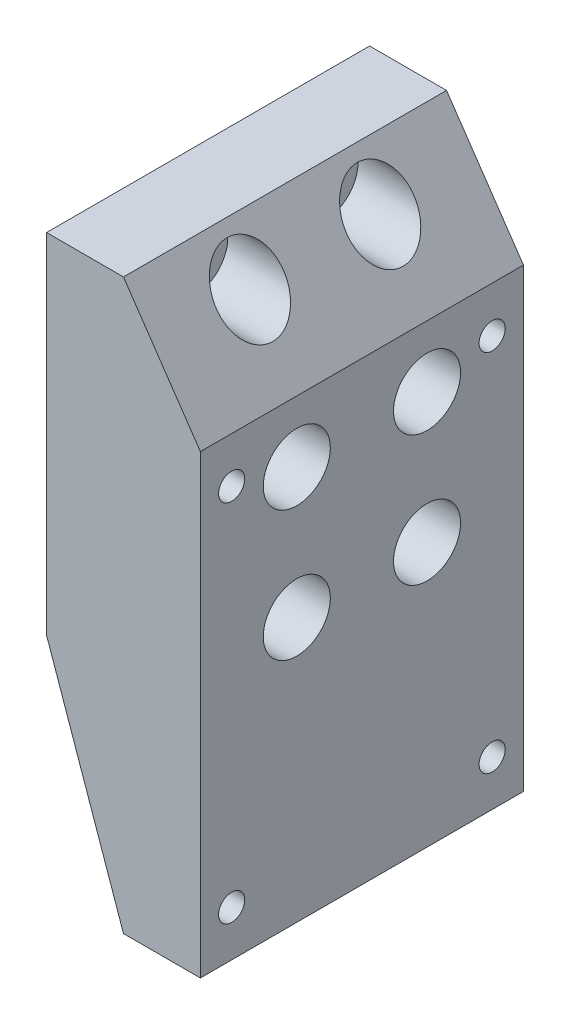
ISO-10303-21;
HEADER;
FILE_DESCRIPTION(('STEP AP214'),'2;1');
FILE_NAME('part.step','',(''),(''),'','','');
FILE_SCHEMA(('AUTOMOTIVE_DESIGN { 1 0 10303 214 1 1 1 1 }'));
ENDSEC;
DATA;
#1=APPLICATION_CONTEXT('core data for automotive mechanical design processes');
#2=APPLICATION_PROTOCOL_DEFINITION('international standard','automotive_design',2000,#1);
#3=PRODUCT_CONTEXT('',#1,'mechanical');
#4=PRODUCT('Part','Part','',(#3));
#5=PRODUCT_RELATED_PRODUCT_CATEGORY('part','',(#4));
#6=PRODUCT_DEFINITION_FORMATION('','',#4);
#7=PRODUCT_DEFINITION_CONTEXT('part definition',#1,'design');
#8=PRODUCT_DEFINITION('design','',#6,#7);
#9=PRODUCT_DEFINITION_SHAPE('','',#8);
#10=(LENGTH_UNIT() NAMED_UNIT(*) SI_UNIT(.MILLI.,.METRE.));
#11=(NAMED_UNIT(*) PLANE_ANGLE_UNIT() SI_UNIT($,.RADIAN.));
#12=(NAMED_UNIT(*) SI_UNIT($,.STERADIAN.) SOLID_ANGLE_UNIT());
#13=UNCERTAINTY_MEASURE_WITH_UNIT(LENGTH_MEASURE(1.E-05),#10,'distance_accuracy_value','');
#14=(GEOMETRIC_REPRESENTATION_CONTEXT(3) GLOBAL_UNCERTAINTY_ASSIGNED_CONTEXT((#13)) GLOBAL_UNIT_ASSIGNED_CONTEXT((#10,
#11,#12)) REPRESENTATION_CONTEXT('',''));
#15=CARTESIAN_POINT('',(0.,0.,0.));
#16=DIRECTION('',(0.,0.,1.));
#17=DIRECTION('',(1.,0.,0.));
#18=AXIS2_PLACEMENT_3D('',#15,#16,#17);
#19=CARTESIAN_POINT('',(24.277424259904,36.7962343326719,18.8));
#20=DIRECTION('',(-1.,0.,0.));
#21=DIRECTION('',(0.,0.,1.));
#22=AXIS2_PLACEMENT_3D('',#19,#20,#21);
#23=CYLINDRICAL_SURFACE('',#22,3.5687);
#24=CARTESIAN_POINT('',(-38.722575740096,36.7962343326719,18.8));
#25=DIRECTION('',(-1.,0.,0.));
#26=DIRECTION('',(0.,0.,1.));
#27=AXIS2_PLACEMENT_3D('',#24,#25,#26);
#28=CIRCLE('',#27,3.5687);
#29=CARTESIAN_POINT('',(-38.722575740096,36.7962343326719,22.3687));
#30=VERTEX_POINT('',#29);
#31=EDGE_CURVE('E133',#30,#30,#28,.T.);
#32=ORIENTED_EDGE('',*,*,#31,.T.);
#33=EDGE_LOOP('',(#32));
#34=FACE_BOUND('',#33,.T.);
#35=CARTESIAN_POINT('',(-28.722575740096,36.7962343326719,18.8));
#36=DIRECTION('',(1.,0.,0.));
#37=DIRECTION('',(0.,1.,0.));
#38=AXIS2_PLACEMENT_3D('',#35,#36,#37);
#39=CIRCLE('',#38,3.5687);
#40=CARTESIAN_POINT('',(-28.722575740096,40.3649343326719,18.8));
#41=VERTEX_POINT('',#40);
#42=EDGE_CURVE('E162',#41,#41,#39,.F.);
#43=ORIENTED_EDGE('',*,*,#42,.F.);
#44=EDGE_LOOP('',(#43));
#45=FACE_BOUND('',#44,.T.);
#46=ADVANCED_FACE('F39',(#34,#45),#23,.F.);
#47=CARTESIAN_POINT('',(24.277424259904,36.7962343326719,44.2));
#48=DIRECTION('',(-1.,0.,0.));
#49=DIRECTION('',(0.,0.,1.));
#50=AXIS2_PLACEMENT_3D('',#47,#48,#49);
#51=CYLINDRICAL_SURFACE('',#50,3.5687);
#52=CARTESIAN_POINT('',(-38.722575740096,36.7962343326719,44.2));
#53=DIRECTION('',(-1.,0.,0.));
#54=DIRECTION('',(0.,0.,1.));
#55=AXIS2_PLACEMENT_3D('',#52,#53,#54);
#56=CIRCLE('',#55,3.5687);
#57=CARTESIAN_POINT('',(-38.722575740096,36.7962343326719,47.7687));
#58=VERTEX_POINT('',#57);
#59=EDGE_CURVE('E187',#58,#58,#56,.T.);
#60=ORIENTED_EDGE('',*,*,#59,.T.);
#61=EDGE_LOOP('',(#60));
#62=FACE_BOUND('',#61,.T.);
#63=CARTESIAN_POINT('',(-28.722575740096,36.7962343326719,44.2));
#64=DIRECTION('',(1.,0.,0.));
#65=DIRECTION('',(0.,1.,0.));
#66=AXIS2_PLACEMENT_3D('',#63,#64,#65);
#67=CIRCLE('',#66,3.5687);
#68=CARTESIAN_POINT('',(-28.722575740096,40.3649343326719,44.2));
#69=VERTEX_POINT('',#68);
#70=EDGE_CURVE('E159',#69,#69,#67,.F.);
#71=ORIENTED_EDGE('',*,*,#70,.F.);
#72=EDGE_LOOP('',(#71));
#73=FACE_BOUND('',#72,.T.);
#74=ADVANCED_FACE('F217',(#62,#73),#51,.F.);
#75=CARTESIAN_POINT('',(24.277424259904,-14.0037656673281,44.2));
#76=DIRECTION('',(-1.,0.,0.));
#77=DIRECTION('',(0.,0.,1.));
#78=AXIS2_PLACEMENT_3D('',#75,#76,#77);
#79=CYLINDRICAL_SURFACE('',#78,3.5687);
#80=CARTESIAN_POINT('',(-38.722575740096,-14.0037656673281,44.2));
#81=DIRECTION('',(-1.,0.,0.));
#82=DIRECTION('',(0.,0.,1.));
#83=AXIS2_PLACEMENT_3D('',#80,#81,#82);
#84=CIRCLE('',#83,3.5687);
#85=CARTESIAN_POINT('',(-38.722575740096,-14.0037656673281,47.7687));
#86=VERTEX_POINT('',#85);
#87=EDGE_CURVE('E169',#86,#86,#84,.T.);
#88=ORIENTED_EDGE('',*,*,#87,.T.);
#89=EDGE_LOOP('',(#88));
#90=FACE_BOUND('',#89,.T.);
#91=CARTESIAN_POINT('',(-28.722575740096,-14.0037656673281,44.2));
#92=DIRECTION('',(1.,0.,0.));
#93=DIRECTION('',(0.,1.,0.));
#94=AXIS2_PLACEMENT_3D('',#91,#92,#93);
#95=CIRCLE('',#94,3.5687);
#96=CARTESIAN_POINT('',(-28.722575740096,-10.4350656673281,44.2));
#97=VERTEX_POINT('',#96);
#98=EDGE_CURVE('E156',#97,#97,#95,.F.);
#99=ORIENTED_EDGE('',*,*,#98,.F.);
#100=EDGE_LOOP('',(#99));
#101=FACE_BOUND('',#100,.T.);
#102=ADVANCED_FACE('F223',(#90,#101),#79,.F.);
#103=CARTESIAN_POINT('',(24.277424259904,11.3962343326719,18.8));
#104=DIRECTION('',(-1.,0.,0.));
#105=DIRECTION('',(0.,0.,1.));
#106=AXIS2_PLACEMENT_3D('',#103,#104,#105);
#107=CYLINDRICAL_SURFACE('',#106,3.5687);
#108=CARTESIAN_POINT('',(-38.722575740096,11.3962343326719,18.8));
#109=DIRECTION('',(-1.,0.,0.));
#110=DIRECTION('',(0.,0.,1.));
#111=AXIS2_PLACEMENT_3D('',#108,#109,#110);
#112=CIRCLE('',#111,3.5687);
#113=CARTESIAN_POINT('',(-38.722575740096,11.3962343326719,22.3687));
#114=VERTEX_POINT('',#113);
#115=EDGE_CURVE('E185',#114,#114,#112,.T.);
#116=ORIENTED_EDGE('',*,*,#115,.T.);
#117=EDGE_LOOP('',(#116));
#118=FACE_BOUND('',#117,.T.);
#119=CARTESIAN_POINT('',(-28.722575740096,11.3962343326719,18.8));
#120=DIRECTION('',(1.,0.,0.));
#121=DIRECTION('',(0.,1.,0.));
#122=AXIS2_PLACEMENT_3D('',#119,#120,#121);
#123=CIRCLE('',#122,3.5687);
#124=CARTESIAN_POINT('',(-28.722575740096,14.9649343326719,18.8));
#125=VERTEX_POINT('',#124);
#126=EDGE_CURVE('E153',#125,#125,#123,.F.);
#127=ORIENTED_EDGE('',*,*,#126,.F.);
#128=EDGE_LOOP('',(#127));
#129=FACE_BOUND('',#128,.T.);
#130=ADVANCED_FACE('F228',(#118,#129),#107,.F.);
#131=CARTESIAN_POINT('',(24.277424259904,11.3962343326719,44.2));
#132=DIRECTION('',(-1.,0.,0.));
#133=DIRECTION('',(0.,0.,1.));
#134=AXIS2_PLACEMENT_3D('',#131,#132,#133);
#135=CYLINDRICAL_SURFACE('',#134,3.5687);
#136=CARTESIAN_POINT('',(-38.722575740096,11.3962343326719,44.2));
#137=DIRECTION('',(-1.,0.,0.));
#138=DIRECTION('',(0.,0.,1.));
#139=AXIS2_PLACEMENT_3D('',#136,#137,#138);
#140=CIRCLE('',#139,3.5687);
#141=CARTESIAN_POINT('',(-38.722575740096,11.3962343326719,47.7687));
#142=VERTEX_POINT('',#141);
#143=EDGE_CURVE('E178',#142,#142,#140,.T.);
#144=ORIENTED_EDGE('',*,*,#143,.T.);
#145=EDGE_LOOP('',(#144));
#146=FACE_BOUND('',#145,.T.);
#147=CARTESIAN_POINT('',(-28.722575740096,11.3962343326719,44.2));
#148=DIRECTION('',(1.,0.,0.));
#149=DIRECTION('',(0.,1.,0.));
#150=AXIS2_PLACEMENT_3D('',#147,#148,#149);
#151=CIRCLE('',#150,3.5687);
#152=CARTESIAN_POINT('',(-28.722575740096,14.9649343326719,44.2));
#153=VERTEX_POINT('',#152);
#154=EDGE_CURVE('E149',#153,#153,#151,.F.);
#155=ORIENTED_EDGE('',*,*,#154,.F.);
#156=EDGE_LOOP('',(#155));
#157=FACE_BOUND('',#156,.T.);
#158=ADVANCED_FACE('F282',(#146,#157),#135,.F.);
#159=CARTESIAN_POINT('',(24.277424259904,-14.0037656673281,18.8));
#160=DIRECTION('',(-1.,0.,0.));
#161=DIRECTION('',(0.,0.,1.));
#162=AXIS2_PLACEMENT_3D('',#159,#160,#161);
#163=CYLINDRICAL_SURFACE('',#162,3.5687);
#164=CARTESIAN_POINT('',(-38.722575740096,-14.0037656673281,18.8));
#165=DIRECTION('',(-1.,0.,0.));
#166=DIRECTION('',(0.,0.,1.));
#167=AXIS2_PLACEMENT_3D('',#164,#165,#166);
#168=CIRCLE('',#167,3.5687);
#169=CARTESIAN_POINT('',(-38.722575740096,-14.0037656673281,22.3687));
#170=VERTEX_POINT('',#169);
#171=EDGE_CURVE('E173',#170,#170,#168,.T.);
#172=ORIENTED_EDGE('',*,*,#171,.T.);
#173=EDGE_LOOP('',(#172));
#174=FACE_BOUND('',#173,.T.);
#175=CARTESIAN_POINT('',(-28.722575740096,-14.0037656673281,18.8));
#176=DIRECTION('',(1.,0.,0.));
#177=DIRECTION('',(0.,1.,0.));
#178=AXIS2_PLACEMENT_3D('',#175,#176,#177);
#179=CIRCLE('',#178,3.5687);
#180=CARTESIAN_POINT('',(-28.722575740096,-10.4350656673281,18.8));
#181=VERTEX_POINT('',#180);
#182=EDGE_CURVE('E146',#181,#181,#179,.F.);
#183=ORIENTED_EDGE('',*,*,#182,.F.);
#184=EDGE_LOOP('',(#183));
#185=FACE_BOUND('',#184,.T.);
#186=ADVANCED_FACE('F285',(#174,#185),#163,.F.);
#187=CARTESIAN_POINT('',(-23.722575740096,45.3962343326719,63.));
#188=DIRECTION('',(0.,-1.,0.));
#189=DIRECTION('',(0.,0.,-1.));
#190=AXIS2_PLACEMENT_3D('',#187,#188,#189);
#191=PLANE('',#190);
#192=DIRECTION('',(-1.,0.,0.));
#193=VECTOR('',#192,1.);
#194=CARTESIAN_POINT('',(-23.722575740096,45.3962343326719,0.));
#195=LINE('',#194,#193);
#196=CARTESIAN_POINT('',(-23.722575740096,45.3962343326719,0.));
#197=VERTEX_POINT('',#196);
#198=CARTESIAN_POINT('',(-38.722575740096,45.3962343326719,0.));
#199=VERTEX_POINT('',#198);
#200=EDGE_CURVE('E129',#197,#199,#195,.T.);
#201=ORIENTED_EDGE('',*,*,#200,.T.);
#202=DIRECTION('',(0.,0.,-1.));
#203=VECTOR('',#202,1.);
#204=CARTESIAN_POINT('',(-38.722575740096,45.3962343326719,63.));
#205=LINE('',#204,#203);
#206=CARTESIAN_POINT('',(-38.722575740096,45.3962343326719,63.));
#207=VERTEX_POINT('',#206);
#208=EDGE_CURVE('E11',#207,#199,#205,.T.);
#209=ORIENTED_EDGE('',*,*,#208,.F.);
#210=DIRECTION('',(-1.,0.,0.));
#211=VECTOR('',#210,1.);
#212=CARTESIAN_POINT('',(-23.722575740096,45.3962343326719,63.));
#213=LINE('',#212,#211);
#214=CARTESIAN_POINT('',(-23.722575740096,45.3962343326719,63.));
#215=VERTEX_POINT('',#214);
#216=EDGE_CURVE('E140',#215,#207,#213,.T.);
#217=ORIENTED_EDGE('',*,*,#216,.F.);
#218=DIRECTION('',(0.,0.,-1.));
#219=VECTOR('',#218,1.);
#220=CARTESIAN_POINT('',(-23.722575740096,45.3962343326719,63.));
#221=LINE('',#220,#219);
#222=EDGE_CURVE('E125',#215,#197,#221,.T.);
#223=ORIENTED_EDGE('',*,*,#222,.T.);
#224=EDGE_LOOP('',(#201,#209,#217,#223));
#225=FACE_BOUND('',#224,.T.);
#226=ADVANCED_FACE('F41',(#225),#191,.F.);
#227=CARTESIAN_POINT('',(-38.722575740096,45.3962343326719,63.));
#228=DIRECTION('',(1.,0.,0.));
#229=DIRECTION('',(0.,1.,0.));
#230=AXIS2_PLACEMENT_3D('',#227,#228,#229);
#231=PLANE('',#230);
#232=ORIENTED_EDGE('',*,*,#171,.F.);
#233=EDGE_LOOP('',(#232));
#234=FACE_BOUND('',#233,.T.);
#235=ORIENTED_EDGE('',*,*,#143,.F.);
#236=EDGE_LOOP('',(#235));
#237=FACE_BOUND('',#236,.T.);
#238=ORIENTED_EDGE('',*,*,#115,.F.);
#239=EDGE_LOOP('',(#238));
#240=FACE_BOUND('',#239,.T.);
#241=ORIENTED_EDGE('',*,*,#59,.F.);
#242=EDGE_LOOP('',(#241));
#243=FACE_BOUND('',#242,.T.);
#244=ORIENTED_EDGE('',*,*,#87,.F.);
#245=EDGE_LOOP('',(#244));
#246=FACE_BOUND('',#245,.T.);
#247=ORIENTED_EDGE('',*,*,#31,.F.);
#248=EDGE_LOOP('',(#247));
#249=FACE_BOUND('',#248,.T.);
#250=DIRECTION('',(0.,-1.,0.));
#251=VECTOR('',#250,1.);
#252=CARTESIAN_POINT('',(-38.722575740096,45.3962343326719,0.));
#253=LINE('',#252,#251);
#254=CARTESIAN_POINT('',(-38.722575740096,-22.6037656673281,0.));
#255=VERTEX_POINT('',#254);
#256=EDGE_CURVE('E132',#199,#255,#253,.T.);
#257=ORIENTED_EDGE('',*,*,#256,.T.);
#258=DIRECTION('',(0.,0.,-1.));
#259=VECTOR('',#258,1.);
#260=CARTESIAN_POINT('',(-38.722575740096,-22.6037656673281,63.));
#261=LINE('',#260,#259);
#262=CARTESIAN_POINT('',(-38.722575740096,-22.6037656673281,63.));
#263=VERTEX_POINT('',#262);
#264=EDGE_CURVE('E49',#263,#255,#261,.T.);
#265=ORIENTED_EDGE('',*,*,#264,.F.);
#266=DIRECTION('',(0.,-1.,0.));
#267=VECTOR('',#266,1.);
#268=CARTESIAN_POINT('',(-38.722575740096,45.3962343326719,63.));
#269=LINE('',#268,#267);
#270=EDGE_CURVE('E96',#207,#263,#269,.T.);
#271=ORIENTED_EDGE('',*,*,#270,.F.);
#272=ORIENTED_EDGE('',*,*,#208,.T.);
#273=EDGE_LOOP('',(#257,#265,#271,#272));
#274=FACE_BOUND('',#273,.T.);
#275=ADVANCED_FACE('F197',(#234,#237,#240,#243,#246,#249,#274),#231,.F.);
#276=CARTESIAN_POINT('',(-38.722575740096,-22.6037656673281,63.));
#277=DIRECTION('',(0.943961223465791,0.330056371841186,0.));
#278=DIRECTION('',(-0.330056371841186,0.943961223465791,0.));
#279=AXIS2_PLACEMENT_3D('',#276,#277,#278);
#280=PLANE('',#279);
#281=DIRECTION('',(0.330056371841186,-0.943961223465791,0.));
#282=VECTOR('',#281,1.);
#283=CARTESIAN_POINT('',(-38.722575740096,-22.6037656673281,0.));
#284=LINE('',#283,#282);
#285=CARTESIAN_POINT('',(-23.722575740096,-65.5037656673281,0.));
#286=VERTEX_POINT('',#285);
#287=EDGE_CURVE('E135',#255,#286,#284,.T.);
#288=ORIENTED_EDGE('',*,*,#287,.T.);
#289=DIRECTION('',(0.,0.,-1.));
#290=VECTOR('',#289,1.);
#291=CARTESIAN_POINT('',(-23.722575740096,-65.5037656673281,63.));
#292=LINE('',#291,#290);
#293=CARTESIAN_POINT('',(-23.722575740096,-65.5037656673281,63.));
#294=VERTEX_POINT('',#293);
#295=EDGE_CURVE('E120',#294,#286,#292,.T.);
#296=ORIENTED_EDGE('',*,*,#295,.F.);
#297=DIRECTION('',(0.330056371841186,-0.943961223465791,0.));
#298=VECTOR('',#297,1.);
#299=CARTESIAN_POINT('',(-38.722575740096,-22.6037656673281,63.));
#300=LINE('',#299,#298);
#301=EDGE_CURVE('E111',#263,#294,#300,.T.);
#302=ORIENTED_EDGE('',*,*,#301,.F.);
#303=ORIENTED_EDGE('',*,*,#264,.T.);
#304=EDGE_LOOP('',(#288,#296,#302,#303));
#305=FACE_BOUND('',#304,.T.);
#306=ADVANCED_FACE('F200',(#305),#280,.F.);
#307=CARTESIAN_POINT('',(-23.722575740096,-65.5037656673281,63.));
#308=DIRECTION('',(0.,1.,0.));
#309=DIRECTION('',(0.,0.,1.));
#310=AXIS2_PLACEMENT_3D('',#307,#308,#309);
#311=PLANE('',#310);
#312=DIRECTION('',(1.,0.,0.));
#313=VECTOR('',#312,1.);
#314=CARTESIAN_POINT('',(-23.722575740096,-65.5037656673281,0.));
#315=LINE('',#314,#313);
#316=CARTESIAN_POINT('',(-8.72257574009599,-65.5037656673281,0.));
#317=VERTEX_POINT('',#316);
#318=EDGE_CURVE('E119',#286,#317,#315,.T.);
#319=ORIENTED_EDGE('',*,*,#318,.T.);
#320=DIRECTION('',(0.,0.,-1.));
#321=VECTOR('',#320,1.);
#322=CARTESIAN_POINT('',(-8.72257574009599,-65.5037656673281,63.));
#323=LINE('',#322,#321);
#324=CARTESIAN_POINT('',(-8.72257574009599,-65.5037656673281,63.));
#325=VERTEX_POINT('',#324);
#326=EDGE_CURVE('E116',#325,#317,#323,.T.);
#327=ORIENTED_EDGE('',*,*,#326,.F.);
#328=DIRECTION('',(1.,0.,0.));
#329=VECTOR('',#328,1.);
#330=CARTESIAN_POINT('',(-23.722575740096,-65.5037656673281,63.));
#331=LINE('',#330,#329);
#332=EDGE_CURVE('E105',#294,#325,#331,.T.);
#333=ORIENTED_EDGE('',*,*,#332,.F.);
#334=ORIENTED_EDGE('',*,*,#295,.T.);
#335=EDGE_LOOP('',(#319,#327,#333,#334));
#336=FACE_BOUND('',#335,.T.);
#337=ADVANCED_FACE('F117',(#336),#311,.F.);
#338=CARTESIAN_POINT('',(-8.72257574009599,-65.5037656673281,63.));
#339=DIRECTION('',(-1.,0.,0.));
#340=DIRECTION('',(0.,0.,1.));
#341=AXIS2_PLACEMENT_3D('',#338,#339,#340);
#342=PLANE('',#341);
#343=CARTESIAN_POINT('',(-8.72257574009599,14.5062343326719,56.9));
#344=DIRECTION('',(1.,0.,0.));
#345=DIRECTION('',(0.,0.,-1.));
#346=AXIS2_PLACEMENT_3D('',#343,#344,#345);
#347=CIRCLE('',#346,2.5527);
#348=CARTESIAN_POINT('',(-8.72257574009599,14.5062343326719,54.3473));
#349=VERTEX_POINT('',#348);
#350=EDGE_CURVE('E522',#349,#349,#347,.T.);
#351=ORIENTED_EDGE('',*,*,#350,.F.);
#352=EDGE_LOOP('',(#351));
#353=FACE_BOUND('',#352,.T.);
#354=CARTESIAN_POINT('',(-8.72257574009599,14.5062343326719,6.10000000000001));
#355=DIRECTION('',(1.,0.,0.));
#356=DIRECTION('',(0.,0.,-1.));
#357=AXIS2_PLACEMENT_3D('',#354,#355,#356);
#358=CIRCLE('',#357,2.5527);
#359=CARTESIAN_POINT('',(-8.72257574009599,14.5062343326719,3.54730000000001));
#360=VERTEX_POINT('',#359);
#361=EDGE_CURVE('E524',#360,#360,#358,.T.);
#362=ORIENTED_EDGE('',*,*,#361,.F.);
#363=EDGE_LOOP('',(#362));
#364=FACE_BOUND('',#363,.T.);
#365=CARTESIAN_POINT('',(-8.72257574009599,-56.6137656673281,56.9));
#366=DIRECTION('',(1.,0.,0.));
#367=DIRECTION('',(0.,0.,-1.));
#368=AXIS2_PLACEMENT_3D('',#365,#366,#367);
#369=CIRCLE('',#368,2.5527);
#370=CARTESIAN_POINT('',(-8.72257574009599,-56.6137656673281,54.3473));
#371=VERTEX_POINT('',#370);
#372=EDGE_CURVE('E532',#371,#371,#369,.T.);
#373=ORIENTED_EDGE('',*,*,#372,.F.);
#374=EDGE_LOOP('',(#373));
#375=FACE_BOUND('',#374,.T.);
#376=CARTESIAN_POINT('',(-8.72257574009599,-56.6137656673281,6.10000000000001));
#377=DIRECTION('',(1.,0.,0.));
#378=DIRECTION('',(0.,0.,-1.));
#379=AXIS2_PLACEMENT_3D('',#376,#377,#378);
#380=CIRCLE('',#379,2.5527);
#381=CARTESIAN_POINT('',(-8.72257574009599,-56.6137656673281,3.54730000000002));
#382=VERTEX_POINT('',#381);
#383=EDGE_CURVE('E538',#382,#382,#380,.T.);
#384=ORIENTED_EDGE('',*,*,#383,.F.);
#385=EDGE_LOOP('',(#384));
#386=FACE_BOUND('',#385,.T.);
#387=CARTESIAN_POINT('',(-8.72257574009599,-14.0037656673281,18.8));
#388=DIRECTION('',(1.,0.,0.));
#389=DIRECTION('',(0.,1.,0.));
#390=AXIS2_PLACEMENT_3D('',#387,#388,#389);
#391=CIRCLE('',#390,6.5405);
#392=CARTESIAN_POINT('',(-8.72257574009599,-7.46326566732811,18.8));
#393=VERTEX_POINT('',#392);
#394=EDGE_CURVE('E550',#393,#393,#391,.T.);
#395=ORIENTED_EDGE('',*,*,#394,.F.);
#396=EDGE_LOOP('',(#395));
#397=FACE_BOUND('',#396,.T.);
#398=CARTESIAN_POINT('',(-8.72257574009599,11.3962343326719,18.8));
#399=DIRECTION('',(1.,0.,0.));
#400=DIRECTION('',(0.,1.,0.));
#401=AXIS2_PLACEMENT_3D('',#398,#399,#400);
#402=CIRCLE('',#401,6.5405);
#403=CARTESIAN_POINT('',(-8.72257574009599,17.9367343326719,18.8));
#404=VERTEX_POINT('',#403);
#405=EDGE_CURVE('E556',#404,#404,#402,.T.);
#406=ORIENTED_EDGE('',*,*,#405,.F.);
#407=EDGE_LOOP('',(#406));
#408=FACE_BOUND('',#407,.T.);
#409=CARTESIAN_POINT('',(-8.72257574009599,11.3962343326719,44.2));
#410=DIRECTION('',(1.,0.,0.));
#411=DIRECTION('',(0.,1.,0.));
#412=AXIS2_PLACEMENT_3D('',#409,#410,#411);
#413=CIRCLE('',#412,6.5405);
#414=CARTESIAN_POINT('',(-8.72257574009599,17.9367343326719,44.2));
#415=VERTEX_POINT('',#414);
#416=EDGE_CURVE('E562',#415,#415,#413,.T.);
#417=ORIENTED_EDGE('',*,*,#416,.F.);
#418=EDGE_LOOP('',(#417));
#419=FACE_BOUND('',#418,.T.);
#420=CARTESIAN_POINT('',(-8.72257574009599,-14.0037656673281,44.2));
#421=DIRECTION('',(1.,0.,0.));
#422=DIRECTION('',(0.,1.,0.));
#423=AXIS2_PLACEMENT_3D('',#420,#421,#422);
#424=CIRCLE('',#423,6.5405);
#425=CARTESIAN_POINT('',(-8.72257574009599,-7.46326566732811,44.2));
#426=VERTEX_POINT('',#425);
#427=EDGE_CURVE('E182',#426,#426,#424,.T.);
#428=ORIENTED_EDGE('',*,*,#427,.F.);
#429=EDGE_LOOP('',(#428));
#430=FACE_BOUND('',#429,.T.);
#431=DIRECTION('',(0.,1.,0.));
#432=VECTOR('',#431,1.);
#433=CARTESIAN_POINT('',(-8.72257574009599,-65.5037656673281,0.));
#434=LINE('',#433,#432);
#435=CARTESIAN_POINT('',(-8.72257574009599,23.3962343326719,0.));
#436=VERTEX_POINT('',#435);
#437=EDGE_CURVE('E82',#317,#436,#434,.T.);
#438=ORIENTED_EDGE('',*,*,#437,.T.);
#439=DIRECTION('',(0.,0.,-1.));
#440=VECTOR('',#439,1.);
#441=CARTESIAN_POINT('',(-8.72257574009599,23.3962343326719,63.));
#442=LINE('',#441,#440);
#443=CARTESIAN_POINT('',(-8.72257574009599,23.3962343326719,63.));
#444=VERTEX_POINT('',#443);
#445=EDGE_CURVE('E121',#444,#436,#442,.T.);
#446=ORIENTED_EDGE('',*,*,#445,.F.);
#447=DIRECTION('',(0.,1.,0.));
#448=VECTOR('',#447,1.);
#449=CARTESIAN_POINT('',(-8.72257574009599,-65.5037656673281,63.));
#450=LINE('',#449,#448);
#451=EDGE_CURVE('E109',#325,#444,#450,.T.);
#452=ORIENTED_EDGE('',*,*,#451,.F.);
#453=ORIENTED_EDGE('',*,*,#326,.T.);
#454=EDGE_LOOP('',(#438,#446,#452,#453));
#455=FACE_BOUND('',#454,.T.);
#456=ADVANCED_FACE('F123',(#353,#364,#375,#386,#397,#408,#419,#430,#455),#342,.F.);
#457=CARTESIAN_POINT('',(-8.72257574009599,23.3962343326719,63.));
#458=DIRECTION('',(-0.826227342807547,-0.56333682464151,0.));
#459=DIRECTION('',(0.56333682464151,-0.826227342807547,0.));
#460=AXIS2_PLACEMENT_3D('',#457,#458,#459);
#461=PLANE('',#460);
#462=CARTESIAN_POINT('',(-17.8589393764596,36.7962343326719,44.2));
#463=DIRECTION('',(-0.826227342807547,-0.56333682464151,0.));
#464=DIRECTION('',(0.56333682464151,-0.826227342807547,0.));
#465=AXIS2_PLACEMENT_3D('',#462,#463,#464);
#466=ELLIPSE('',#465,7.91610209579262,6.5405);
#467=CARTESIAN_POINT('',(-13.3995075582778,30.2557343326719,44.2));
#468=VERTEX_POINT('',#467);
#469=EDGE_CURVE('E43',#468,#468,#466,.T.);
#470=ORIENTED_EDGE('',*,*,#469,.T.);
#471=EDGE_LOOP('',(#470));
#472=FACE_BOUND('',#471,.T.);
#473=CARTESIAN_POINT('',(-17.8589393764596,36.7962343326719,18.8));
#474=DIRECTION('',(-0.826227342807547,-0.56333682464151,0.));
#475=DIRECTION('',(0.56333682464151,-0.826227342807547,0.));
#476=AXIS2_PLACEMENT_3D('',#473,#474,#475);
#477=ELLIPSE('',#476,7.91610209579263,6.5405);
#478=CARTESIAN_POINT('',(-13.3995075582778,30.2557343326719,18.8));
#479=VERTEX_POINT('',#478);
#480=EDGE_CURVE('E164',#479,#479,#477,.T.);
#481=ORIENTED_EDGE('',*,*,#480,.T.);
#482=EDGE_LOOP('',(#481));
#483=FACE_BOUND('',#482,.T.);
#484=DIRECTION('',(-0.56333682464151,0.826227342807547,0.));
#485=VECTOR('',#484,1.);
#486=CARTESIAN_POINT('',(-8.72257574009599,23.3962343326719,0.));
#487=LINE('',#486,#485);
#488=EDGE_CURVE('E88',#436,#197,#487,.T.);
#489=ORIENTED_EDGE('',*,*,#488,.T.);
#490=ORIENTED_EDGE('',*,*,#222,.F.);
#491=DIRECTION('',(-0.56333682464151,0.826227342807547,0.));
#492=VECTOR('',#491,1.);
#493=CARTESIAN_POINT('',(-8.72257574009599,23.3962343326719,63.));
#494=LINE('',#493,#492);
#495=EDGE_CURVE('E58',#444,#215,#494,.T.);
#496=ORIENTED_EDGE('',*,*,#495,.F.);
#497=ORIENTED_EDGE('',*,*,#445,.T.);
#498=EDGE_LOOP('',(#489,#490,#496,#497));
#499=FACE_BOUND('',#498,.T.);
#500=ADVANCED_FACE('F205',(#472,#483,#499),#461,.F.);
#501=CARTESIAN_POINT('',(0.,0.,63.));
#502=DIRECTION('',(0.,0.,1.));
#503=DIRECTION('',(1.,0.,0.));
#504=AXIS2_PLACEMENT_3D('',#501,#502,#503);
#505=PLANE('',#504);
#506=ORIENTED_EDGE('',*,*,#216,.T.);
#507=ORIENTED_EDGE('',*,*,#270,.T.);
#508=ORIENTED_EDGE('',*,*,#301,.T.);
#509=ORIENTED_EDGE('',*,*,#332,.T.);
#510=ORIENTED_EDGE('',*,*,#451,.T.);
#511=ORIENTED_EDGE('',*,*,#495,.T.);
#512=EDGE_LOOP('',(#506,#507,#508,#509,#510,#511));
#513=FACE_BOUND('',#512,.T.);
#514=ADVANCED_FACE('F107',(#513),#505,.T.);
#515=CARTESIAN_POINT('',(0.,0.,0.));
#516=DIRECTION('',(0.,0.,1.));
#517=DIRECTION('',(1.,0.,0.));
#518=AXIS2_PLACEMENT_3D('',#515,#516,#517);
#519=PLANE('',#518);
#520=ORIENTED_EDGE('',*,*,#200,.F.);
#521=ORIENTED_EDGE('',*,*,#488,.F.);
#522=ORIENTED_EDGE('',*,*,#437,.F.);
#523=ORIENTED_EDGE('',*,*,#318,.F.);
#524=ORIENTED_EDGE('',*,*,#287,.F.);
#525=ORIENTED_EDGE('',*,*,#256,.F.);
#526=EDGE_LOOP('',(#520,#521,#522,#523,#524,#525));
#527=FACE_BOUND('',#526,.T.);
#528=ADVANCED_FACE('F203',(#527),#519,.F.);
#529=CARTESIAN_POINT('',(-28.722575740096,-14.0037656673281,18.8));
#530=DIRECTION('',(1.,0.,0.));
#531=DIRECTION('',(0.,1.,0.));
#532=AXIS2_PLACEMENT_3D('',#529,#530,#531);
#533=PLANE('',#532);
#534=CARTESIAN_POINT('',(-28.722575740096,-14.0037656673281,18.8));
#535=DIRECTION('',(1.,0.,0.));
#536=DIRECTION('',(0.,1.,0.));
#537=AXIS2_PLACEMENT_3D('',#534,#535,#536);
#538=CIRCLE('',#537,6.5405);
#539=CARTESIAN_POINT('',(-28.722575740096,-7.46326566732811,18.8));
#540=VERTEX_POINT('',#539);
#541=EDGE_CURVE('E548',#540,#540,#538,.T.);
#542=ORIENTED_EDGE('',*,*,#541,.T.);
#543=EDGE_LOOP('',(#542));
#544=FACE_BOUND('',#543,.T.);
#545=ORIENTED_EDGE('',*,*,#182,.T.);
#546=EDGE_LOOP('',(#545));
#547=FACE_BOUND('',#546,.T.);
#548=ADVANCED_FACE('F230',(#544,#547),#533,.T.);
#549=CARTESIAN_POINT('',(-28.722575740096,-14.0037656673281,18.8));
#550=DIRECTION('',(1.,0.,0.));
#551=DIRECTION('',(0.,1.,0.));
#552=AXIS2_PLACEMENT_3D('',#549,#550,#551);
#553=CYLINDRICAL_SURFACE('',#552,6.5405);
#554=ORIENTED_EDGE('',*,*,#541,.F.);
#555=EDGE_LOOP('',(#554));
#556=FACE_BOUND('',#555,.T.);
#557=ORIENTED_EDGE('',*,*,#394,.T.);
#558=EDGE_LOOP('',(#557));
#559=FACE_BOUND('',#558,.T.);
#560=ADVANCED_FACE('F234',(#556,#559),#553,.F.);
#561=CARTESIAN_POINT('',(-28.722575740096,11.3962343326719,44.2));
#562=DIRECTION('',(1.,0.,0.));
#563=DIRECTION('',(0.,1.,0.));
#564=AXIS2_PLACEMENT_3D('',#561,#562,#563);
#565=PLANE('',#564);
#566=CARTESIAN_POINT('',(-28.722575740096,11.3962343326719,44.2));
#567=DIRECTION('',(1.,0.,0.));
#568=DIRECTION('',(0.,1.,0.));
#569=AXIS2_PLACEMENT_3D('',#566,#567,#568);
#570=CIRCLE('',#569,6.5405);
#571=CARTESIAN_POINT('',(-28.722575740096,17.9367343326719,44.2));
#572=VERTEX_POINT('',#571);
#573=EDGE_CURVE('E559',#572,#572,#570,.T.);
#574=ORIENTED_EDGE('',*,*,#573,.T.);
#575=EDGE_LOOP('',(#574));
#576=FACE_BOUND('',#575,.T.);
#577=ORIENTED_EDGE('',*,*,#154,.T.);
#578=EDGE_LOOP('',(#577));
#579=FACE_BOUND('',#578,.T.);
#580=ADVANCED_FACE('F240',(#576,#579),#565,.T.);
#581=CARTESIAN_POINT('',(-28.722575740096,11.3962343326719,44.2));
#582=DIRECTION('',(1.,0.,0.));
#583=DIRECTION('',(0.,1.,0.));
#584=AXIS2_PLACEMENT_3D('',#581,#582,#583);
#585=CYLINDRICAL_SURFACE('',#584,6.5405);
#586=ORIENTED_EDGE('',*,*,#573,.F.);
#587=EDGE_LOOP('',(#586));
#588=FACE_BOUND('',#587,.T.);
#589=ORIENTED_EDGE('',*,*,#416,.T.);
#590=EDGE_LOOP('',(#589));
#591=FACE_BOUND('',#590,.T.);
#592=ADVANCED_FACE('F253',(#588,#591),#585,.F.);
#593=CARTESIAN_POINT('',(-28.722575740096,11.3962343326719,18.8));
#594=DIRECTION('',(1.,0.,0.));
#595=DIRECTION('',(0.,1.,0.));
#596=AXIS2_PLACEMENT_3D('',#593,#594,#595);
#597=PLANE('',#596);
#598=CARTESIAN_POINT('',(-28.722575740096,11.3962343326719,18.8));
#599=DIRECTION('',(1.,0.,0.));
#600=DIRECTION('',(0.,1.,0.));
#601=AXIS2_PLACEMENT_3D('',#598,#599,#600);
#602=CIRCLE('',#601,6.5405);
#603=CARTESIAN_POINT('',(-28.722575740096,17.9367343326719,18.8));
#604=VERTEX_POINT('',#603);
#605=EDGE_CURVE('E553',#604,#604,#602,.T.);
#606=ORIENTED_EDGE('',*,*,#605,.T.);
#607=EDGE_LOOP('',(#606));
#608=FACE_BOUND('',#607,.T.);
#609=ORIENTED_EDGE('',*,*,#126,.T.);
#610=EDGE_LOOP('',(#609));
#611=FACE_BOUND('',#610,.T.);
#612=ADVANCED_FACE('F249',(#608,#611),#597,.T.);
#613=CARTESIAN_POINT('',(-28.722575740096,11.3962343326719,18.8));
#614=DIRECTION('',(1.,0.,0.));
#615=DIRECTION('',(0.,1.,0.));
#616=AXIS2_PLACEMENT_3D('',#613,#614,#615);
#617=CYLINDRICAL_SURFACE('',#616,6.5405);
#618=ORIENTED_EDGE('',*,*,#605,.F.);
#619=EDGE_LOOP('',(#618));
#620=FACE_BOUND('',#619,.T.);
#621=ORIENTED_EDGE('',*,*,#405,.T.);
#622=EDGE_LOOP('',(#621));
#623=FACE_BOUND('',#622,.T.);
#624=ADVANCED_FACE('F252',(#620,#623),#617,.F.);
#625=CARTESIAN_POINT('',(-28.722575740096,-14.0037656673281,44.2));
#626=DIRECTION('',(1.,0.,0.));
#627=DIRECTION('',(0.,1.,0.));
#628=AXIS2_PLACEMENT_3D('',#625,#626,#627);
#629=PLANE('',#628);
#630=CARTESIAN_POINT('',(-28.722575740096,-14.0037656673281,44.2));
#631=DIRECTION('',(1.,0.,0.));
#632=DIRECTION('',(0.,1.,0.));
#633=AXIS2_PLACEMENT_3D('',#630,#631,#632);
#634=CIRCLE('',#633,6.5405);
#635=CARTESIAN_POINT('',(-28.722575740096,-7.46326566732811,44.2));
#636=VERTEX_POINT('',#635);
#637=EDGE_CURVE('E150',#636,#636,#634,.T.);
#638=ORIENTED_EDGE('',*,*,#637,.T.);
#639=EDGE_LOOP('',(#638));
#640=FACE_BOUND('',#639,.T.);
#641=ORIENTED_EDGE('',*,*,#98,.T.);
#642=EDGE_LOOP('',(#641));
#643=FACE_BOUND('',#642,.T.);
#644=ADVANCED_FACE('F257',(#640,#643),#629,.T.);
#645=CARTESIAN_POINT('',(-28.722575740096,-14.0037656673281,44.2));
#646=DIRECTION('',(1.,0.,0.));
#647=DIRECTION('',(0.,1.,0.));
#648=AXIS2_PLACEMENT_3D('',#645,#646,#647);
#649=CYLINDRICAL_SURFACE('',#648,6.5405);
#650=ORIENTED_EDGE('',*,*,#637,.F.);
#651=EDGE_LOOP('',(#650));
#652=FACE_BOUND('',#651,.T.);
#653=ORIENTED_EDGE('',*,*,#427,.T.);
#654=EDGE_LOOP('',(#653));
#655=FACE_BOUND('',#654,.T.);
#656=ADVANCED_FACE('F272',(#652,#655),#649,.F.);
#657=CARTESIAN_POINT('',(-28.722575740096,36.7962343326719,44.2));
#658=DIRECTION('',(1.,0.,0.));
#659=DIRECTION('',(0.,1.,0.));
#660=AXIS2_PLACEMENT_3D('',#657,#658,#659);
#661=CYLINDRICAL_SURFACE('',#660,6.5405);
#662=CARTESIAN_POINT('',(-28.722575740096,36.7962343326719,44.2));
#663=DIRECTION('',(1.,0.,0.));
#664=DIRECTION('',(0.,1.,0.));
#665=AXIS2_PLACEMENT_3D('',#662,#663,#664);
#666=CIRCLE('',#665,6.5405);
#667=CARTESIAN_POINT('',(-28.722575740096,43.3367343326719,44.2));
#668=VERTEX_POINT('',#667);
#669=EDGE_CURVE('E547',#668,#668,#666,.T.);
#670=ORIENTED_EDGE('',*,*,#669,.F.);
#671=EDGE_LOOP('',(#670));
#672=FACE_BOUND('',#671,.T.);
#673=ORIENTED_EDGE('',*,*,#469,.F.);
#674=EDGE_LOOP('',(#673));
#675=FACE_BOUND('',#674,.T.);
#676=ADVANCED_FACE('F268',(#672,#675),#661,.F.);
#677=CARTESIAN_POINT('',(-28.722575740096,36.7962343326719,44.2));
#678=DIRECTION('',(1.,0.,0.));
#679=DIRECTION('',(0.,1.,0.));
#680=AXIS2_PLACEMENT_3D('',#677,#678,#679);
#681=PLANE('',#680);
#682=ORIENTED_EDGE('',*,*,#669,.T.);
#683=EDGE_LOOP('',(#682));
#684=FACE_BOUND('',#683,.T.);
#685=ORIENTED_EDGE('',*,*,#70,.T.);
#686=EDGE_LOOP('',(#685));
#687=FACE_BOUND('',#686,.T.);
#688=ADVANCED_FACE('F265',(#684,#687),#681,.T.);
#689=CARTESIAN_POINT('',(-28.722575740096,36.7962343326719,18.8));
#690=DIRECTION('',(1.,0.,0.));
#691=DIRECTION('',(0.,1.,0.));
#692=AXIS2_PLACEMENT_3D('',#689,#690,#691);
#693=CYLINDRICAL_SURFACE('',#692,6.5405);
#694=CARTESIAN_POINT('',(-28.722575740096,36.7962343326719,18.8));
#695=DIRECTION('',(1.,0.,0.));
#696=DIRECTION('',(0.,1.,0.));
#697=AXIS2_PLACEMENT_3D('',#694,#695,#696);
#698=CIRCLE('',#697,6.5405);
#699=CARTESIAN_POINT('',(-28.722575740096,43.3367343326719,18.8));
#700=VERTEX_POINT('',#699);
#701=EDGE_CURVE('E544',#700,#700,#698,.T.);
#702=ORIENTED_EDGE('',*,*,#701,.F.);
#703=EDGE_LOOP('',(#702));
#704=FACE_BOUND('',#703,.T.);
#705=ORIENTED_EDGE('',*,*,#480,.F.);
#706=EDGE_LOOP('',(#705));
#707=FACE_BOUND('',#706,.T.);
#708=ADVANCED_FACE('F246',(#704,#707),#693,.F.);
#709=CARTESIAN_POINT('',(-28.722575740096,36.7962343326719,18.8));
#710=DIRECTION('',(1.,0.,0.));
#711=DIRECTION('',(0.,1.,0.));
#712=AXIS2_PLACEMENT_3D('',#709,#710,#711);
#713=PLANE('',#712);
#714=ORIENTED_EDGE('',*,*,#701,.T.);
#715=EDGE_LOOP('',(#714));
#716=FACE_BOUND('',#715,.T.);
#717=ORIENTED_EDGE('',*,*,#42,.T.);
#718=EDGE_LOOP('',(#717));
#719=FACE_BOUND('',#718,.T.);
#720=ADVANCED_FACE('F401',(#716,#719),#713,.T.);
#721=CARTESIAN_POINT('',(-18.722575740096,-56.6137656673281,6.10000000000001));
#722=DIRECTION('',(1.,0.,0.));
#723=DIRECTION('',(0.,0.,-1.));
#724=AXIS2_PLACEMENT_3D('',#721,#722,#723);
#725=CONICAL_SURFACE('',#724,2.5527,1.02974425867665);
#726=CARTESIAN_POINT('',(-20.2563926422876,-56.6137656673281,6.10000000000001));
#727=VERTEX_POINT('',#726);
#728=VERTEX_LOOP('',#727);
#729=FACE_BOUND('',#728,.T.);
#730=CARTESIAN_POINT('',(-18.722575740096,-56.6137656673281,6.10000000000001));
#731=DIRECTION('',(1.,0.,0.));
#732=DIRECTION('',(0.,0.,-1.));
#733=AXIS2_PLACEMENT_3D('',#730,#731,#732);
#734=CIRCLE('',#733,2.5527);
#735=CARTESIAN_POINT('',(-18.722575740096,-56.6137656673281,3.54730000000002));
#736=VERTEX_POINT('',#735);
#737=EDGE_CURVE('E541',#736,#736,#734,.T.);
#738=ORIENTED_EDGE('',*,*,#737,.T.);
#739=EDGE_LOOP('',(#738));
#740=FACE_BOUND('',#739,.T.);
#741=ADVANCED_FACE('F410',(#729,#740),#725,.F.);
#742=CARTESIAN_POINT('',(-8.72257574009599,-56.6137656673281,6.10000000000001));
#743=DIRECTION('',(1.,0.,0.));
#744=DIRECTION('',(0.,0.,-1.));
#745=AXIS2_PLACEMENT_3D('',#742,#743,#744);
#746=CYLINDRICAL_SURFACE('',#745,2.5527);
#747=ORIENTED_EDGE('',*,*,#737,.F.);
#748=EDGE_LOOP('',(#747));
#749=FACE_BOUND('',#748,.T.);
#750=ORIENTED_EDGE('',*,*,#383,.T.);
#751=EDGE_LOOP('',(#750));
#752=FACE_BOUND('',#751,.T.);
#753=ADVANCED_FACE('F426',(#749,#752),#746,.F.);
#754=CARTESIAN_POINT('',(-18.722575740096,-56.6137656673281,56.9));
#755=DIRECTION('',(1.,0.,0.));
#756=DIRECTION('',(0.,0.,-1.));
#757=AXIS2_PLACEMENT_3D('',#754,#755,#756);
#758=CONICAL_SURFACE('',#757,2.5527,1.02974425867665);
#759=CARTESIAN_POINT('',(-20.2563926422876,-56.6137656673281,56.9));
#760=VERTEX_POINT('',#759);
#761=VERTEX_LOOP('',#760);
#762=FACE_BOUND('',#761,.T.);
#763=CARTESIAN_POINT('',(-18.722575740096,-56.6137656673281,56.9));
#764=DIRECTION('',(1.,0.,0.));
#765=DIRECTION('',(0.,0.,-1.));
#766=AXIS2_PLACEMENT_3D('',#763,#764,#765);
#767=CIRCLE('',#766,2.5527);
#768=CARTESIAN_POINT('',(-18.722575740096,-56.6137656673281,54.3473));
#769=VERTEX_POINT('',#768);
#770=EDGE_CURVE('E535',#769,#769,#767,.T.);
#771=ORIENTED_EDGE('',*,*,#770,.T.);
#772=EDGE_LOOP('',(#771));
#773=FACE_BOUND('',#772,.T.);
#774=ADVANCED_FACE('F437',(#762,#773),#758,.F.);
#775=CARTESIAN_POINT('',(-8.72257574009599,-56.6137656673281,56.9));
#776=DIRECTION('',(1.,0.,0.));
#777=DIRECTION('',(0.,0.,-1.));
#778=AXIS2_PLACEMENT_3D('',#775,#776,#777);
#779=CYLINDRICAL_SURFACE('',#778,2.5527);
#780=ORIENTED_EDGE('',*,*,#770,.F.);
#781=EDGE_LOOP('',(#780));
#782=FACE_BOUND('',#781,.T.);
#783=ORIENTED_EDGE('',*,*,#372,.T.);
#784=EDGE_LOOP('',(#783));
#785=FACE_BOUND('',#784,.T.);
#786=ADVANCED_FACE('F449',(#782,#785),#779,.F.);
#787=CARTESIAN_POINT('',(-18.722575740096,14.5062343326719,6.10000000000001));
#788=DIRECTION('',(1.,0.,0.));
#789=DIRECTION('',(0.,0.,-1.));
#790=AXIS2_PLACEMENT_3D('',#787,#788,#789);
#791=CONICAL_SURFACE('',#790,2.5527,1.02974425867665);
#792=CARTESIAN_POINT('',(-20.2563926422876,14.5062343326719,6.10000000000001));
#793=VERTEX_POINT('',#792);
#794=VERTEX_LOOP('',#793);
#795=FACE_BOUND('',#794,.T.);
#796=CARTESIAN_POINT('',(-18.722575740096,14.5062343326719,6.10000000000001));
#797=DIRECTION('',(1.,0.,0.));
#798=DIRECTION('',(0.,0.,-1.));
#799=AXIS2_PLACEMENT_3D('',#796,#797,#798);
#800=CIRCLE('',#799,2.5527);
#801=CARTESIAN_POINT('',(-18.722575740096,14.5062343326719,3.54730000000001));
#802=VERTEX_POINT('',#801);
#803=EDGE_CURVE('E529',#802,#802,#800,.T.);
#804=ORIENTED_EDGE('',*,*,#803,.T.);
#805=EDGE_LOOP('',(#804));
#806=FACE_BOUND('',#805,.T.);
#807=ADVANCED_FACE('F459',(#795,#806),#791,.F.);
#808=CARTESIAN_POINT('',(-8.72257574009599,14.5062343326719,6.10000000000001));
#809=DIRECTION('',(1.,0.,0.));
#810=DIRECTION('',(0.,0.,-1.));
#811=AXIS2_PLACEMENT_3D('',#808,#809,#810);
#812=CYLINDRICAL_SURFACE('',#811,2.5527);
#813=ORIENTED_EDGE('',*,*,#803,.F.);
#814=EDGE_LOOP('',(#813));
#815=FACE_BOUND('',#814,.T.);
#816=ORIENTED_EDGE('',*,*,#361,.T.);
#817=EDGE_LOOP('',(#816));
#818=FACE_BOUND('',#817,.T.);
#819=ADVANCED_FACE('F471',(#815,#818),#812,.F.);
#820=CARTESIAN_POINT('',(-18.722575740096,14.5062343326719,56.9));
#821=DIRECTION('',(1.,0.,0.));
#822=DIRECTION('',(0.,0.,-1.));
#823=AXIS2_PLACEMENT_3D('',#820,#821,#822);
#824=CONICAL_SURFACE('',#823,2.5527,1.02974425867665);
#825=CARTESIAN_POINT('',(-20.2563926422876,14.5062343326719,56.9));
#826=VERTEX_POINT('',#825);
#827=VERTEX_LOOP('',#826);
#828=FACE_BOUND('',#827,.T.);
#829=CARTESIAN_POINT('',(-18.722575740096,14.5062343326719,56.9));
#830=DIRECTION('',(1.,0.,0.));
#831=DIRECTION('',(0.,0.,-1.));
#832=AXIS2_PLACEMENT_3D('',#829,#830,#831);
#833=CIRCLE('',#832,2.5527);
#834=CARTESIAN_POINT('',(-18.722575740096,14.5062343326719,54.3473));
#835=VERTEX_POINT('',#834);
#836=EDGE_CURVE('E519',#835,#835,#833,.T.);
#837=ORIENTED_EDGE('',*,*,#836,.T.);
#838=EDGE_LOOP('',(#837));
#839=FACE_BOUND('',#838,.T.);
#840=ADVANCED_FACE('F481',(#828,#839),#824,.F.);
#841=CARTESIAN_POINT('',(-8.72257574009599,14.5062343326719,56.9));
#842=DIRECTION('',(1.,0.,0.));
#843=DIRECTION('',(0.,0.,-1.));
#844=AXIS2_PLACEMENT_3D('',#841,#842,#843);
#845=CYLINDRICAL_SURFACE('',#844,2.5527);
#846=ORIENTED_EDGE('',*,*,#836,.F.);
#847=EDGE_LOOP('',(#846));
#848=FACE_BOUND('',#847,.T.);
#849=ORIENTED_EDGE('',*,*,#350,.T.);
#850=EDGE_LOOP('',(#849));
#851=FACE_BOUND('',#850,.T.);
#852=ADVANCED_FACE('F493',(#848,#851),#845,.F.);
#853=CLOSED_SHELL('',(#46,#74,#102,#130,#158,#186,#226,#275,#306,#337,#456,#500,#514,#528,#548,
#560,#580,#592,#612,#624,#644,#656,#676,#688,#708,#720,#741,#753,#774,#786,#807,#819,#840,#852));
#854=MANIFOLD_SOLID_BREP('B2',#853);
#855=ADVANCED_BREP_SHAPE_REPRESENTATION('',(#18,#854),#14);
#856=SHAPE_DEFINITION_REPRESENTATION(#9,#855);
ENDSEC;
END-ISO-10303-21;
